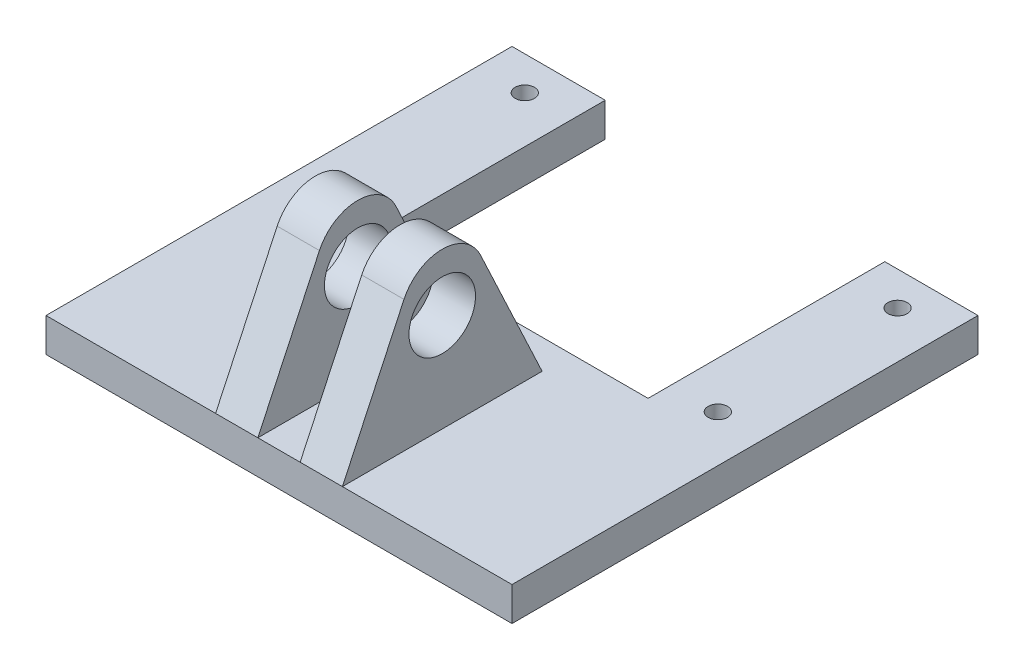
ISO-10303-21;
HEADER;
FILE_DESCRIPTION(('STEP AP214'),'2;1');
FILE_NAME('part.step','',(''),(''),'','','');
FILE_SCHEMA(('AUTOMOTIVE_DESIGN { 1 0 10303 214 1 1 1 1 }'));
ENDSEC;
DATA;
#1=APPLICATION_CONTEXT('core data for automotive mechanical design processes');
#2=APPLICATION_PROTOCOL_DEFINITION('international standard','automotive_design',2000,#1);
#3=PRODUCT_CONTEXT('',#1,'mechanical');
#4=PRODUCT('Part','Part','',(#3));
#5=PRODUCT_RELATED_PRODUCT_CATEGORY('part','',(#4));
#6=PRODUCT_DEFINITION_FORMATION('','',#4);
#7=PRODUCT_DEFINITION_CONTEXT('part definition',#1,'design');
#8=PRODUCT_DEFINITION('design','',#6,#7);
#9=PRODUCT_DEFINITION_SHAPE('','',#8);
#10=(LENGTH_UNIT() NAMED_UNIT(*) SI_UNIT(.MILLI.,.METRE.));
#11=(NAMED_UNIT(*) PLANE_ANGLE_UNIT() SI_UNIT($,.RADIAN.));
#12=(NAMED_UNIT(*) SI_UNIT($,.STERADIAN.) SOLID_ANGLE_UNIT());
#13=UNCERTAINTY_MEASURE_WITH_UNIT(LENGTH_MEASURE(1.E-05),#10,'distance_accuracy_value','');
#14=(GEOMETRIC_REPRESENTATION_CONTEXT(3) GLOBAL_UNCERTAINTY_ASSIGNED_CONTEXT((#13)) GLOBAL_UNIT_ASSIGNED_CONTEXT((#10,
#11,#12)) REPRESENTATION_CONTEXT('',''));
#15=CARTESIAN_POINT('',(0.,0.,0.));
#16=DIRECTION('',(0.,0.,1.));
#17=DIRECTION('',(1.,0.,0.));
#18=AXIS2_PLACEMENT_3D('',#15,#16,#17);
#19=CARTESIAN_POINT('',(4.7625,18.54,-7.5));
#20=DIRECTION('',(0.,-0.42443387623072,-0.905458935958868));
#21=DIRECTION('',(0.,0.905458935958868,-0.42443387623072));
#22=AXIS2_PLACEMENT_3D('',#19,#20,#21);
#23=PLANE('',#22);
#24=DIRECTION('',(0.,-0.905458935958868,0.42443387623072));
#25=VECTOR('',#24,1.);
#26=CARTESIAN_POINT('',(-1.5875,18.54,-7.5));
#27=LINE('',#26,#25);
#28=CARTESIAN_POINT('',(-1.5875,12.4070248071053,-4.62516787833059));
#29=VERTEX_POINT('',#28);
#30=CARTESIAN_POINT('',(-1.5875,2.54,0.));
#31=VERTEX_POINT('',#30);
#32=EDGE_CURVE('E158',#29,#31,#27,.T.);
#33=ORIENTED_EDGE('',*,*,#32,.F.);
#34=DIRECTION('',(-1.,0.,0.));
#35=VECTOR('',#34,1.);
#36=CARTESIAN_POINT('',(4.7625,12.4070248071053,-4.62516787833059));
#37=LINE('',#36,#35);
#38=CARTESIAN_POINT('',(-4.7625,12.4070248071053,-4.62516787833059));
#39=VERTEX_POINT('',#38);
#40=EDGE_CURVE('E311',#29,#39,#37,.T.);
#41=ORIENTED_EDGE('',*,*,#40,.T.);
#42=DIRECTION('',(0.,-0.905458935958868,0.42443387623072));
#43=VECTOR('',#42,1.);
#44=CARTESIAN_POINT('',(-4.7625,18.54,-7.5));
#45=LINE('',#44,#43);
#46=CARTESIAN_POINT('',(-4.7625,2.54,0.));
#47=VERTEX_POINT('',#46);
#48=EDGE_CURVE('E167',#39,#47,#45,.T.);
#49=ORIENTED_EDGE('',*,*,#48,.T.);
#50=DIRECTION('',(-1.,0.,0.));
#51=VECTOR('',#50,1.);
#52=CARTESIAN_POINT('',(4.7625,2.54,0.));
#53=LINE('',#52,#51);
#54=EDGE_CURVE('E182',#31,#47,#53,.T.);
#55=ORIENTED_EDGE('',*,*,#54,.F.);
#56=EDGE_LOOP('',(#33,#41,#49,#55));
#57=FACE_BOUND('',#56,.T.);
#58=ADVANCED_FACE('F45',(#57),#23,.F.);
#59=DIRECTION('',(0.,-0.905458935958868,0.42443387623072));
#60=VECTOR('',#59,1.);
#61=CARTESIAN_POINT('',(4.7625,18.54,-7.5));
#62=LINE('',#61,#60);
#63=CARTESIAN_POINT('',(4.7625,12.4070248071053,-4.62516787833059));
#64=VERTEX_POINT('',#63);
#65=CARTESIAN_POINT('',(4.7625,2.54,0.));
#66=VERTEX_POINT('',#65);
#67=EDGE_CURVE('E205',#64,#66,#62,.T.);
#68=ORIENTED_EDGE('',*,*,#67,.F.);
#69=DIRECTION('',(-1.,0.,0.));
#70=VECTOR('',#69,1.);
#71=CARTESIAN_POINT('',(4.7625,12.4070248071053,-4.62516787833059));
#72=LINE('',#71,#70);
#73=CARTESIAN_POINT('',(1.5875,12.4070248071053,-4.62516787833059));
#74=VERTEX_POINT('',#73);
#75=EDGE_CURVE('E302',#64,#74,#72,.T.);
#76=ORIENTED_EDGE('',*,*,#75,.T.);
#77=DIRECTION('',(0.,0.905458935958868,-0.42443387623072));
#78=VECTOR('',#77,1.);
#79=CARTESIAN_POINT('',(1.5875,18.54,-7.5));
#80=LINE('',#79,#78);
#81=CARTESIAN_POINT('',(1.5875,2.54,0.));
#82=VERTEX_POINT('',#81);
#83=EDGE_CURVE('E201',#82,#74,#80,.T.);
#84=ORIENTED_EDGE('',*,*,#83,.F.);
#85=EDGE_CURVE('E186',#66,#82,#53,.T.);
#86=ORIENTED_EDGE('',*,*,#85,.F.);
#87=EDGE_LOOP('',(#68,#76,#84,#86));
#88=FACE_BOUND('',#87,.T.);
#89=ADVANCED_FACE('F341',(#88),#23,.F.);
#90=CARTESIAN_POINT('',(4.7625,2.54,-15.));
#91=DIRECTION('',(0.,-0.424433876230719,0.905458935958868));
#92=DIRECTION('',(0.,-0.905458935958869,-0.42443387623072));
#93=AXIS2_PLACEMENT_3D('',#90,#91,#92);
#94=PLANE('',#93);
#95=DIRECTION('',(0.,0.905458935958869,0.42443387623072));
#96=VECTOR('',#95,1.);
#97=CARTESIAN_POINT('',(-4.7625,2.54,-15.));
#98=LINE('',#97,#96);
#99=CARTESIAN_POINT('',(-4.7625,2.54,-15.));
#100=VERTEX_POINT('',#99);
#101=CARTESIAN_POINT('',(-4.7625,12.4070248071053,-10.3748321216694));
#102=VERTEX_POINT('',#101);
#103=EDGE_CURVE('E208',#100,#102,#98,.T.);
#104=ORIENTED_EDGE('',*,*,#103,.T.);
#105=DIRECTION('',(-1.,0.,0.));
#106=VECTOR('',#105,1.);
#107=CARTESIAN_POINT('',(4.7625,12.4070248071053,-10.3748321216694));
#108=LINE('',#107,#106);
#109=CARTESIAN_POINT('',(-1.5875,12.4070248071053,-10.3748321216694));
#110=VERTEX_POINT('',#109);
#111=EDGE_CURVE('E54',#102,#110,#108,.F.);
#112=ORIENTED_EDGE('',*,*,#111,.T.);
#113=DIRECTION('',(0.,0.905458935958869,0.42443387623072));
#114=VECTOR('',#113,1.);
#115=CARTESIAN_POINT('',(-1.5875,2.54,-15.));
#116=LINE('',#115,#114);
#117=CARTESIAN_POINT('',(-1.5875,2.54,-15.));
#118=VERTEX_POINT('',#117);
#119=EDGE_CURVE('E168',#118,#110,#116,.T.);
#120=ORIENTED_EDGE('',*,*,#119,.F.);
#121=DIRECTION('',(-1.,0.,0.));
#122=VECTOR('',#121,1.);
#123=CARTESIAN_POINT('',(4.7625,2.54,-15.));
#124=LINE('',#123,#122);
#125=EDGE_CURVE('E178',#118,#100,#124,.T.);
#126=ORIENTED_EDGE('',*,*,#125,.T.);
#127=EDGE_LOOP('',(#104,#112,#120,#126));
#128=FACE_BOUND('',#127,.T.);
#129=ADVANCED_FACE('F364',(#128),#94,.F.);
#130=DIRECTION('',(0.,-0.905458935958869,-0.42443387623072));
#131=VECTOR('',#130,1.);
#132=CARTESIAN_POINT('',(1.5875,2.54,-15.));
#133=LINE('',#132,#131);
#134=CARTESIAN_POINT('',(1.5875,12.4070248071053,-10.3748321216694));
#135=VERTEX_POINT('',#134);
#136=CARTESIAN_POINT('',(1.5875,2.54,-15.));
#137=VERTEX_POINT('',#136);
#138=EDGE_CURVE('E196',#135,#137,#133,.T.);
#139=ORIENTED_EDGE('',*,*,#138,.F.);
#140=DIRECTION('',(-1.,0.,0.));
#141=VECTOR('',#140,1.);
#142=CARTESIAN_POINT('',(4.7625,12.4070248071053,-10.3748321216694));
#143=LINE('',#142,#141);
#144=CARTESIAN_POINT('',(4.7625,12.4070248071053,-10.3748321216694));
#145=VERTEX_POINT('',#144);
#146=EDGE_CURVE('E307',#135,#145,#143,.F.);
#147=ORIENTED_EDGE('',*,*,#146,.T.);
#148=DIRECTION('',(0.,0.905458935958869,0.42443387623072));
#149=VECTOR('',#148,1.);
#150=CARTESIAN_POINT('',(4.7625,2.54,-15.));
#151=LINE('',#150,#149);
#152=CARTESIAN_POINT('',(4.7625,2.54,-15.));
#153=VERTEX_POINT('',#152);
#154=EDGE_CURVE('E211',#153,#145,#151,.T.);
#155=ORIENTED_EDGE('',*,*,#154,.F.);
#156=EDGE_CURVE('E187',#153,#137,#124,.T.);
#157=ORIENTED_EDGE('',*,*,#156,.T.);
#158=EDGE_LOOP('',(#139,#147,#155,#157));
#159=FACE_BOUND('',#158,.T.);
#160=ADVANCED_FACE('F346',(#159),#94,.F.);
#161=CARTESIAN_POINT('',(0.,2.54,0.));
#162=DIRECTION('',(0.,-1.,0.));
#163=DIRECTION('',(0.,0.,-1.));
#164=AXIS2_PLACEMENT_3D('',#161,#162,#163);
#165=PLANE('',#164);
#166=CARTESIAN_POINT('',(14.,2.54,-18.96));
#167=DIRECTION('',(0.,1.,0.));
#168=DIRECTION('',(0.,0.,1.));
#169=AXIS2_PLACEMENT_3D('',#166,#167,#168);
#170=CIRCLE('',#169,0.725);
#171=CARTESIAN_POINT('',(14.,2.54,-18.235));
#172=VERTEX_POINT('',#171);
#173=EDGE_CURVE('E221',#172,#172,#170,.T.);
#174=ORIENTED_EDGE('',*,*,#173,.F.);
#175=EDGE_LOOP('',(#174));
#176=FACE_BOUND('',#175,.T.);
#177=CARTESIAN_POINT('',(14.,2.54,-32.46));
#178=DIRECTION('',(0.,1.,0.));
#179=DIRECTION('',(0.,0.,1.));
#180=AXIS2_PLACEMENT_3D('',#177,#178,#179);
#181=CIRCLE('',#180,0.725000000000001);
#182=CARTESIAN_POINT('',(14.,2.54,-31.735));
#183=VERTEX_POINT('',#182);
#184=EDGE_CURVE('E227',#183,#183,#181,.T.);
#185=ORIENTED_EDGE('',*,*,#184,.F.);
#186=EDGE_LOOP('',(#185));
#187=FACE_BOUND('',#186,.T.);
#188=CARTESIAN_POINT('',(-14.,2.54,-18.96));
#189=DIRECTION('',(0.,1.,0.));
#190=DIRECTION('',(0.,0.,1.));
#191=AXIS2_PLACEMENT_3D('',#188,#189,#190);
#192=CIRCLE('',#191,0.725);
#193=CARTESIAN_POINT('',(-14.,2.54,-18.235));
#194=VERTEX_POINT('',#193);
#195=EDGE_CURVE('E233',#194,#194,#192,.T.);
#196=ORIENTED_EDGE('',*,*,#195,.F.);
#197=EDGE_LOOP('',(#196));
#198=FACE_BOUND('',#197,.T.);
#199=CARTESIAN_POINT('',(-14.,2.54,-32.46));
#200=DIRECTION('',(0.,1.,0.));
#201=DIRECTION('',(0.,0.,1.));
#202=AXIS2_PLACEMENT_3D('',#199,#200,#201);
#203=CIRCLE('',#202,0.725000000000001);
#204=CARTESIAN_POINT('',(-14.,2.54,-31.735));
#205=VERTEX_POINT('',#204);
#206=EDGE_CURVE('E239',#205,#205,#203,.T.);
#207=ORIENTED_EDGE('',*,*,#206,.F.);
#208=EDGE_LOOP('',(#207));
#209=FACE_BOUND('',#208,.T.);
#210=DIRECTION('',(0.,0.,1.));
#211=VECTOR('',#210,1.);
#212=CARTESIAN_POINT('',(-4.7625,2.54,-15.));
#213=LINE('',#212,#211);
#214=EDGE_CURVE('E215',#100,#47,#213,.T.);
#215=ORIENTED_EDGE('',*,*,#214,.F.);
#216=ORIENTED_EDGE('',*,*,#125,.F.);
#217=DIRECTION('',(0.,0.,1.));
#218=VECTOR('',#217,1.);
#219=CARTESIAN_POINT('',(-1.5875,2.54,0.));
#220=LINE('',#219,#218);
#221=EDGE_CURVE('E161',#118,#31,#220,.T.);
#222=ORIENTED_EDGE('',*,*,#221,.T.);
#223=DIRECTION('',(1.,0.,0.));
#224=VECTOR('',#223,1.);
#225=CARTESIAN_POINT('',(-1.5875,2.54,0.));
#226=LINE('',#225,#224);
#227=EDGE_CURVE('E176',#31,#82,#226,.T.);
#228=ORIENTED_EDGE('',*,*,#227,.T.);
#229=DIRECTION('',(0.,0.,-1.));
#230=VECTOR('',#229,1.);
#231=CARTESIAN_POINT('',(1.5875,2.54,0.));
#232=LINE('',#231,#230);
#233=EDGE_CURVE('E194',#82,#137,#232,.T.);
#234=ORIENTED_EDGE('',*,*,#233,.T.);
#235=ORIENTED_EDGE('',*,*,#156,.F.);
#236=DIRECTION('',(0.,0.,1.));
#237=VECTOR('',#236,1.);
#238=CARTESIAN_POINT('',(4.7625,2.54,-15.));
#239=LINE('',#238,#237);
#240=EDGE_CURVE('E207',#153,#66,#239,.T.);
#241=ORIENTED_EDGE('',*,*,#240,.T.);
#242=DIRECTION('',(1.,0.,0.));
#243=VECTOR('',#242,1.);
#244=CARTESIAN_POINT('',(17.5,2.54,0.));
#245=LINE('',#244,#243);
#246=CARTESIAN_POINT('',(17.5,2.54,0.));
#247=VERTEX_POINT('',#246);
#248=EDGE_CURVE('E249',#66,#247,#245,.T.);
#249=ORIENTED_EDGE('',*,*,#248,.T.);
#250=DIRECTION('',(0.,0.,-1.));
#251=VECTOR('',#250,1.);
#252=CARTESIAN_POINT('',(17.5,2.54,-35.));
#253=LINE('',#252,#251);
#254=CARTESIAN_POINT('',(17.5,2.54,-35.));
#255=VERTEX_POINT('',#254);
#256=EDGE_CURVE('E248',#247,#255,#253,.T.);
#257=ORIENTED_EDGE('',*,*,#256,.T.);
#258=DIRECTION('',(-1.,0.,0.));
#259=VECTOR('',#258,1.);
#260=CARTESIAN_POINT('',(10.5,2.54,-35.));
#261=LINE('',#260,#259);
#262=CARTESIAN_POINT('',(10.5,2.54,-35.));
#263=VERTEX_POINT('',#262);
#264=EDGE_CURVE('E251',#255,#263,#261,.T.);
#265=ORIENTED_EDGE('',*,*,#264,.T.);
#266=DIRECTION('',(0.,0.,1.));
#267=VECTOR('',#266,1.);
#268=CARTESIAN_POINT('',(10.5,2.54,-17.22));
#269=LINE('',#268,#267);
#270=CARTESIAN_POINT('',(10.5,2.54,-17.22));
#271=VERTEX_POINT('',#270);
#272=EDGE_CURVE('E253',#263,#271,#269,.T.);
#273=ORIENTED_EDGE('',*,*,#272,.T.);
#274=DIRECTION('',(-1.,0.,0.));
#275=VECTOR('',#274,1.);
#276=CARTESIAN_POINT('',(-10.5,2.54,-17.22));
#277=LINE('',#276,#275);
#278=CARTESIAN_POINT('',(-10.5,2.54,-17.22));
#279=VERTEX_POINT('',#278);
#280=EDGE_CURVE('E255',#271,#279,#277,.T.);
#281=ORIENTED_EDGE('',*,*,#280,.T.);
#282=DIRECTION('',(0.,0.,-1.));
#283=VECTOR('',#282,1.);
#284=CARTESIAN_POINT('',(-10.5,2.54,-35.));
#285=LINE('',#284,#283);
#286=CARTESIAN_POINT('',(-10.5,2.54,-35.));
#287=VERTEX_POINT('',#286);
#288=EDGE_CURVE('E257',#279,#287,#285,.T.);
#289=ORIENTED_EDGE('',*,*,#288,.T.);
#290=DIRECTION('',(-1.,0.,0.));
#291=VECTOR('',#290,1.);
#292=CARTESIAN_POINT('',(-17.5,2.54,-35.));
#293=LINE('',#292,#291);
#294=CARTESIAN_POINT('',(-17.5,2.54,-35.));
#295=VERTEX_POINT('',#294);
#296=EDGE_CURVE('E259',#287,#295,#293,.T.);
#297=ORIENTED_EDGE('',*,*,#296,.T.);
#298=DIRECTION('',(0.,0.,1.));
#299=VECTOR('',#298,1.);
#300=CARTESIAN_POINT('',(-17.5,2.54,0.));
#301=LINE('',#300,#299);
#302=CARTESIAN_POINT('',(-17.5,2.54,0.));
#303=VERTEX_POINT('',#302);
#304=EDGE_CURVE('E261',#295,#303,#301,.T.);
#305=ORIENTED_EDGE('',*,*,#304,.T.);
#306=EDGE_CURVE('E245',#303,#47,#245,.T.);
#307=ORIENTED_EDGE('',*,*,#306,.T.);
#308=EDGE_LOOP('',(#215,#216,#222,#228,#234,#235,#241,#249,#257,#265,#273,#281,#289,#297,#305,#307));
#309=FACE_BOUND('',#308,.T.);
#310=ADVANCED_FACE('F173',(#176,#187,#198,#209,#309),#165,.F.);
#311=CARTESIAN_POINT('',(0.,0.,0.));
#312=DIRECTION('',(0.,-1.,0.));
#313=DIRECTION('',(0.,0.,-1.));
#314=AXIS2_PLACEMENT_3D('',#311,#312,#313);
#315=PLANE('',#314);
#316=CARTESIAN_POINT('',(14.,0.,-32.46));
#317=DIRECTION('',(0.,1.,0.));
#318=DIRECTION('',(0.,0.,1.));
#319=AXIS2_PLACEMENT_3D('',#316,#317,#318);
#320=CIRCLE('',#319,0.725000000000001);
#321=CARTESIAN_POINT('',(14.,0.,-31.735));
#322=VERTEX_POINT('',#321);
#323=EDGE_CURVE('E224',#322,#322,#320,.T.);
#324=ORIENTED_EDGE('',*,*,#323,.T.);
#325=EDGE_LOOP('',(#324));
#326=FACE_BOUND('',#325,.T.);
#327=CARTESIAN_POINT('',(-14.,0.,-32.46));
#328=DIRECTION('',(0.,1.,0.));
#329=DIRECTION('',(0.,0.,1.));
#330=AXIS2_PLACEMENT_3D('',#327,#328,#329);
#331=CIRCLE('',#330,0.725000000000001);
#332=CARTESIAN_POINT('',(-14.,0.,-31.735));
#333=VERTEX_POINT('',#332);
#334=EDGE_CURVE('E236',#333,#333,#331,.T.);
#335=ORIENTED_EDGE('',*,*,#334,.T.);
#336=EDGE_LOOP('',(#335));
#337=FACE_BOUND('',#336,.T.);
#338=DIRECTION('',(1.,0.,0.));
#339=VECTOR('',#338,1.);
#340=CARTESIAN_POINT('',(17.5,0.,0.));
#341=LINE('',#340,#339);
#342=CARTESIAN_POINT('',(-17.5,0.,0.));
#343=VERTEX_POINT('',#342);
#344=CARTESIAN_POINT('',(17.5,0.,0.));
#345=VERTEX_POINT('',#344);
#346=EDGE_CURVE('E242',#343,#345,#341,.T.);
#347=ORIENTED_EDGE('',*,*,#346,.F.);
#348=DIRECTION('',(0.,0.,1.));
#349=VECTOR('',#348,1.);
#350=CARTESIAN_POINT('',(-17.5,0.,0.));
#351=LINE('',#350,#349);
#352=CARTESIAN_POINT('',(-17.5,0.,-35.));
#353=VERTEX_POINT('',#352);
#354=EDGE_CURVE('E277',#353,#343,#351,.T.);
#355=ORIENTED_EDGE('',*,*,#354,.F.);
#356=DIRECTION('',(-1.,0.,0.));
#357=VECTOR('',#356,1.);
#358=CARTESIAN_POINT('',(-17.5,0.,-35.));
#359=LINE('',#358,#357);
#360=CARTESIAN_POINT('',(-10.5,0.,-35.));
#361=VERTEX_POINT('',#360);
#362=EDGE_CURVE('E275',#361,#353,#359,.T.);
#363=ORIENTED_EDGE('',*,*,#362,.F.);
#364=DIRECTION('',(0.,0.,-1.));
#365=VECTOR('',#364,1.);
#366=CARTESIAN_POINT('',(-10.5,0.,-35.));
#367=LINE('',#366,#365);
#368=CARTESIAN_POINT('',(-10.5,0.,-17.22));
#369=VERTEX_POINT('',#368);
#370=EDGE_CURVE('E273',#369,#361,#367,.T.);
#371=ORIENTED_EDGE('',*,*,#370,.F.);
#372=DIRECTION('',(-1.,0.,0.));
#373=VECTOR('',#372,1.);
#374=CARTESIAN_POINT('',(-10.5,0.,-17.22));
#375=LINE('',#374,#373);
#376=CARTESIAN_POINT('',(10.5,0.,-17.22));
#377=VERTEX_POINT('',#376);
#378=EDGE_CURVE('E271',#377,#369,#375,.T.);
#379=ORIENTED_EDGE('',*,*,#378,.F.);
#380=DIRECTION('',(0.,0.,1.));
#381=VECTOR('',#380,1.);
#382=CARTESIAN_POINT('',(10.5,0.,-17.22));
#383=LINE('',#382,#381);
#384=CARTESIAN_POINT('',(10.5,0.,-35.));
#385=VERTEX_POINT('',#384);
#386=EDGE_CURVE('E269',#385,#377,#383,.T.);
#387=ORIENTED_EDGE('',*,*,#386,.F.);
#388=DIRECTION('',(-1.,0.,0.));
#389=VECTOR('',#388,1.);
#390=CARTESIAN_POINT('',(10.5,0.,-35.));
#391=LINE('',#390,#389);
#392=CARTESIAN_POINT('',(17.5,0.,-35.));
#393=VERTEX_POINT('',#392);
#394=EDGE_CURVE('E267',#393,#385,#391,.T.);
#395=ORIENTED_EDGE('',*,*,#394,.F.);
#396=DIRECTION('',(0.,0.,-1.));
#397=VECTOR('',#396,1.);
#398=CARTESIAN_POINT('',(17.5,0.,-35.));
#399=LINE('',#398,#397);
#400=EDGE_CURVE('E265',#345,#393,#399,.T.);
#401=ORIENTED_EDGE('',*,*,#400,.F.);
#402=EDGE_LOOP('',(#347,#355,#363,#371,#379,#387,#395,#401));
#403=FACE_BOUND('',#402,.T.);
#404=CARTESIAN_POINT('',(-14.,0.,-18.96));
#405=DIRECTION('',(0.,1.,0.));
#406=DIRECTION('',(0.,0.,1.));
#407=AXIS2_PLACEMENT_3D('',#404,#405,#406);
#408=CIRCLE('',#407,0.725);
#409=CARTESIAN_POINT('',(-14.,0.,-18.235));
#410=VERTEX_POINT('',#409);
#411=EDGE_CURVE('E230',#410,#410,#408,.T.);
#412=ORIENTED_EDGE('',*,*,#411,.T.);
#413=EDGE_LOOP('',(#412));
#414=FACE_BOUND('',#413,.T.);
#415=CARTESIAN_POINT('',(14.,0.,-18.96));
#416=DIRECTION('',(0.,1.,0.));
#417=DIRECTION('',(0.,0.,1.));
#418=AXIS2_PLACEMENT_3D('',#415,#416,#417);
#419=CIRCLE('',#418,0.725);
#420=CARTESIAN_POINT('',(14.,0.,-18.235));
#421=VERTEX_POINT('',#420);
#422=EDGE_CURVE('E220',#421,#421,#419,.T.);
#423=ORIENTED_EDGE('',*,*,#422,.T.);
#424=EDGE_LOOP('',(#423));
#425=FACE_BOUND('',#424,.T.);
#426=ADVANCED_FACE('F323',(#326,#337,#403,#414,#425),#315,.T.);
#427=CARTESIAN_POINT('',(17.5,2.54,0.));
#428=DIRECTION('',(0.,0.,-1.));
#429=DIRECTION('',(-1.,0.,0.));
#430=AXIS2_PLACEMENT_3D('',#427,#428,#429);
#431=PLANE('',#430);
#432=ORIENTED_EDGE('',*,*,#346,.T.);
#433=DIRECTION('',(0.,-1.,0.));
#434=VECTOR('',#433,1.);
#435=CARTESIAN_POINT('',(17.5,2.54,0.));
#436=LINE('',#435,#434);
#437=EDGE_CURVE('E299',#247,#345,#436,.T.);
#438=ORIENTED_EDGE('',*,*,#437,.F.);
#439=ORIENTED_EDGE('',*,*,#248,.F.);
#440=ORIENTED_EDGE('',*,*,#85,.T.);
#441=ORIENTED_EDGE('',*,*,#227,.F.);
#442=ORIENTED_EDGE('',*,*,#54,.T.);
#443=ORIENTED_EDGE('',*,*,#306,.F.);
#444=DIRECTION('',(0.,-1.,0.));
#445=VECTOR('',#444,1.);
#446=CARTESIAN_POINT('',(-17.5,2.54,0.));
#447=LINE('',#446,#445);
#448=EDGE_CURVE('E263',#303,#343,#447,.T.);
#449=ORIENTED_EDGE('',*,*,#448,.T.);
#450=EDGE_LOOP('',(#432,#438,#439,#440,#441,#442,#443,#449));
#451=FACE_BOUND('',#450,.T.);
#452=ADVANCED_FACE('F191',(#451),#431,.F.);
#453=CARTESIAN_POINT('',(17.5,2.54,-35.));
#454=DIRECTION('',(-1.,0.,0.));
#455=DIRECTION('',(0.,0.,1.));
#456=AXIS2_PLACEMENT_3D('',#453,#454,#455);
#457=PLANE('',#456);
#458=ORIENTED_EDGE('',*,*,#400,.T.);
#459=DIRECTION('',(0.,-1.,0.));
#460=VECTOR('',#459,1.);
#461=CARTESIAN_POINT('',(17.5,2.54,-35.));
#462=LINE('',#461,#460);
#463=EDGE_CURVE('E296',#255,#393,#462,.T.);
#464=ORIENTED_EDGE('',*,*,#463,.F.);
#465=ORIENTED_EDGE('',*,*,#256,.F.);
#466=ORIENTED_EDGE('',*,*,#437,.T.);
#467=EDGE_LOOP('',(#458,#464,#465,#466));
#468=FACE_BOUND('',#467,.T.);
#469=ADVANCED_FACE('F331',(#468),#457,.F.);
#470=CARTESIAN_POINT('',(10.5,2.54,-35.));
#471=DIRECTION('',(0.,0.,1.));
#472=DIRECTION('',(1.,0.,0.));
#473=AXIS2_PLACEMENT_3D('',#470,#471,#472);
#474=PLANE('',#473);
#475=ORIENTED_EDGE('',*,*,#394,.T.);
#476=DIRECTION('',(0.,-1.,0.));
#477=VECTOR('',#476,1.);
#478=CARTESIAN_POINT('',(10.5,2.54,-35.));
#479=LINE('',#478,#477);
#480=EDGE_CURVE('E293',#263,#385,#479,.T.);
#481=ORIENTED_EDGE('',*,*,#480,.F.);
#482=ORIENTED_EDGE('',*,*,#264,.F.);
#483=ORIENTED_EDGE('',*,*,#463,.T.);
#484=EDGE_LOOP('',(#475,#481,#482,#483));
#485=FACE_BOUND('',#484,.T.);
#486=ADVANCED_FACE('F408',(#485),#474,.F.);
#487=CARTESIAN_POINT('',(10.5,2.54,-17.22));
#488=DIRECTION('',(1.,0.,0.));
#489=DIRECTION('',(0.,0.,-1.));
#490=AXIS2_PLACEMENT_3D('',#487,#488,#489);
#491=PLANE('',#490);
#492=ORIENTED_EDGE('',*,*,#386,.T.);
#493=DIRECTION('',(0.,-1.,0.));
#494=VECTOR('',#493,1.);
#495=CARTESIAN_POINT('',(10.5,2.54,-17.22));
#496=LINE('',#495,#494);
#497=EDGE_CURVE('E290',#271,#377,#496,.T.);
#498=ORIENTED_EDGE('',*,*,#497,.F.);
#499=ORIENTED_EDGE('',*,*,#272,.F.);
#500=ORIENTED_EDGE('',*,*,#480,.T.);
#501=EDGE_LOOP('',(#492,#498,#499,#500));
#502=FACE_BOUND('',#501,.T.);
#503=ADVANCED_FACE('F404',(#502),#491,.F.);
#504=CARTESIAN_POINT('',(-10.5,2.54,-17.22));
#505=DIRECTION('',(0.,0.,1.));
#506=DIRECTION('',(1.,0.,0.));
#507=AXIS2_PLACEMENT_3D('',#504,#505,#506);
#508=PLANE('',#507);
#509=ORIENTED_EDGE('',*,*,#378,.T.);
#510=DIRECTION('',(0.,-1.,0.));
#511=VECTOR('',#510,1.);
#512=CARTESIAN_POINT('',(-10.5,2.54,-17.22));
#513=LINE('',#512,#511);
#514=EDGE_CURVE('E287',#279,#369,#513,.T.);
#515=ORIENTED_EDGE('',*,*,#514,.F.);
#516=ORIENTED_EDGE('',*,*,#280,.F.);
#517=ORIENTED_EDGE('',*,*,#497,.T.);
#518=EDGE_LOOP('',(#509,#515,#516,#517));
#519=FACE_BOUND('',#518,.T.);
#520=ADVANCED_FACE('F400',(#519),#508,.F.);
#521=CARTESIAN_POINT('',(-10.5,2.54,-35.));
#522=DIRECTION('',(-1.,0.,0.));
#523=DIRECTION('',(0.,0.,1.));
#524=AXIS2_PLACEMENT_3D('',#521,#522,#523);
#525=PLANE('',#524);
#526=ORIENTED_EDGE('',*,*,#370,.T.);
#527=DIRECTION('',(0.,-1.,0.));
#528=VECTOR('',#527,1.);
#529=CARTESIAN_POINT('',(-10.5,2.54,-35.));
#530=LINE('',#529,#528);
#531=EDGE_CURVE('E284',#287,#361,#530,.T.);
#532=ORIENTED_EDGE('',*,*,#531,.F.);
#533=ORIENTED_EDGE('',*,*,#288,.F.);
#534=ORIENTED_EDGE('',*,*,#514,.T.);
#535=EDGE_LOOP('',(#526,#532,#533,#534));
#536=FACE_BOUND('',#535,.T.);
#537=ADVANCED_FACE('F396',(#536),#525,.F.);
#538=CARTESIAN_POINT('',(-17.5,2.54,-35.));
#539=DIRECTION('',(0.,0.,1.));
#540=DIRECTION('',(1.,0.,0.));
#541=AXIS2_PLACEMENT_3D('',#538,#539,#540);
#542=PLANE('',#541);
#543=ORIENTED_EDGE('',*,*,#362,.T.);
#544=DIRECTION('',(0.,-1.,0.));
#545=VECTOR('',#544,1.);
#546=CARTESIAN_POINT('',(-17.5,2.54,-35.));
#547=LINE('',#546,#545);
#548=EDGE_CURVE('E281',#295,#353,#547,.T.);
#549=ORIENTED_EDGE('',*,*,#548,.F.);
#550=ORIENTED_EDGE('',*,*,#296,.F.);
#551=ORIENTED_EDGE('',*,*,#531,.T.);
#552=EDGE_LOOP('',(#543,#549,#550,#551));
#553=FACE_BOUND('',#552,.T.);
#554=ADVANCED_FACE('F393',(#553),#542,.F.);
#555=CARTESIAN_POINT('',(-17.5,2.54,0.));
#556=DIRECTION('',(1.,0.,0.));
#557=DIRECTION('',(0.,0.,-1.));
#558=AXIS2_PLACEMENT_3D('',#555,#556,#557);
#559=PLANE('',#558);
#560=ORIENTED_EDGE('',*,*,#354,.T.);
#561=ORIENTED_EDGE('',*,*,#448,.F.);
#562=ORIENTED_EDGE('',*,*,#304,.F.);
#563=ORIENTED_EDGE('',*,*,#548,.T.);
#564=EDGE_LOOP('',(#560,#561,#562,#563));
#565=FACE_BOUND('',#564,.T.);
#566=ADVANCED_FACE('F383',(#565),#559,.F.);
#567=CARTESIAN_POINT('',(-14.,2.54,-32.46));
#568=DIRECTION('',(0.,-1.,0.));
#569=DIRECTION('',(0.,0.,-1.));
#570=AXIS2_PLACEMENT_3D('',#567,#568,#569);
#571=CYLINDRICAL_SURFACE('',#570,0.725000000000001);
#572=ORIENTED_EDGE('',*,*,#206,.T.);
#573=EDGE_LOOP('',(#572));
#574=FACE_BOUND('',#573,.T.);
#575=ORIENTED_EDGE('',*,*,#334,.F.);
#576=EDGE_LOOP('',(#575));
#577=FACE_BOUND('',#576,.T.);
#578=ADVANCED_FACE('F379',(#574,#577),#571,.F.);
#579=CARTESIAN_POINT('',(-14.,2.54,-18.96));
#580=DIRECTION('',(0.,-1.,0.));
#581=DIRECTION('',(0.,0.,-1.));
#582=AXIS2_PLACEMENT_3D('',#579,#580,#581);
#583=CYLINDRICAL_SURFACE('',#582,0.725);
#584=ORIENTED_EDGE('',*,*,#195,.T.);
#585=EDGE_LOOP('',(#584));
#586=FACE_BOUND('',#585,.T.);
#587=ORIENTED_EDGE('',*,*,#411,.F.);
#588=EDGE_LOOP('',(#587));
#589=FACE_BOUND('',#588,.T.);
#590=ADVANCED_FACE('F375',(#586,#589),#583,.F.);
#591=CARTESIAN_POINT('',(14.,2.54,-32.46));
#592=DIRECTION('',(0.,-1.,0.));
#593=DIRECTION('',(0.,0.,-1.));
#594=AXIS2_PLACEMENT_3D('',#591,#592,#593);
#595=CYLINDRICAL_SURFACE('',#594,0.725000000000001);
#596=ORIENTED_EDGE('',*,*,#184,.T.);
#597=EDGE_LOOP('',(#596));
#598=FACE_BOUND('',#597,.T.);
#599=ORIENTED_EDGE('',*,*,#323,.F.);
#600=EDGE_LOOP('',(#599));
#601=FACE_BOUND('',#600,.T.);
#602=ADVANCED_FACE('F371',(#598,#601),#595,.F.);
#603=CARTESIAN_POINT('',(14.,2.54,-18.96));
#604=DIRECTION('',(0.,-1.,0.));
#605=DIRECTION('',(0.,0.,-1.));
#606=AXIS2_PLACEMENT_3D('',#603,#604,#605);
#607=CYLINDRICAL_SURFACE('',#606,0.725);
#608=ORIENTED_EDGE('',*,*,#173,.T.);
#609=EDGE_LOOP('',(#608));
#610=FACE_BOUND('',#609,.T.);
#611=ORIENTED_EDGE('',*,*,#422,.F.);
#612=EDGE_LOOP('',(#611));
#613=FACE_BOUND('',#612,.T.);
#614=ADVANCED_FACE('F368',(#610,#613),#607,.F.);
#615=CARTESIAN_POINT('',(4.7625,0.,0.));
#616=DIRECTION('',(-1.,0.,0.));
#617=DIRECTION('',(0.,0.,1.));
#618=AXIS2_PLACEMENT_3D('',#615,#616,#617);
#619=PLANE('',#618);
#620=CARTESIAN_POINT('',(4.7625,9.94,-7.5));
#621=DIRECTION('',(-1.,0.,0.));
#622=DIRECTION('',(0.,0.,1.));
#623=AXIS2_PLACEMENT_3D('',#620,#621,#622);
#624=CIRCLE('',#623,2.49999999999999);
#625=CARTESIAN_POINT('',(4.7625,9.94,-5.00000000000001));
#626=VERTEX_POINT('',#625);
#627=EDGE_CURVE('E179',#626,#626,#624,.T.);
#628=ORIENTED_EDGE('',*,*,#627,.T.);
#629=EDGE_LOOP('',(#628));
#630=FACE_BOUND('',#629,.T.);
#631=ORIENTED_EDGE('',*,*,#154,.T.);
#632=CARTESIAN_POINT('',(4.7625,11.0594472500727,-7.5));
#633=DIRECTION('',(-1.,0.,0.));
#634=DIRECTION('',(0.,0.,1.));
#635=AXIS2_PLACEMENT_3D('',#632,#633,#634);
#636=CIRCLE('',#635,3.175);
#637=EDGE_CURVE('E309',#145,#64,#636,.F.);
#638=ORIENTED_EDGE('',*,*,#637,.T.);
#639=ORIENTED_EDGE('',*,*,#67,.T.);
#640=ORIENTED_EDGE('',*,*,#240,.F.);
#641=EDGE_LOOP('',(#631,#638,#639,#640));
#642=FACE_BOUND('',#641,.T.);
#643=ADVANCED_FACE('F335',(#630,#642),#619,.F.);
#644=CARTESIAN_POINT('',(-4.7625,0.,0.));
#645=DIRECTION('',(-1.,0.,0.));
#646=DIRECTION('',(0.,0.,1.));
#647=AXIS2_PLACEMENT_3D('',#644,#645,#646);
#648=PLANE('',#647);
#649=CARTESIAN_POINT('',(-4.7625,9.94,-7.5));
#650=DIRECTION('',(-1.,0.,0.));
#651=DIRECTION('',(0.,0.,1.));
#652=AXIS2_PLACEMENT_3D('',#649,#650,#651);
#653=CIRCLE('',#652,2.49999999999999);
#654=CARTESIAN_POINT('',(-4.7625,9.94,-5.00000000000001));
#655=VERTEX_POINT('',#654);
#656=EDGE_CURVE('E521',#655,#655,#653,.T.);
#657=ORIENTED_EDGE('',*,*,#656,.F.);
#658=EDGE_LOOP('',(#657));
#659=FACE_BOUND('',#658,.T.);
#660=ORIENTED_EDGE('',*,*,#48,.F.);
#661=CARTESIAN_POINT('',(-4.7625,11.0594472500727,-7.5));
#662=DIRECTION('',(-1.,0.,0.));
#663=DIRECTION('',(0.,0.,1.));
#664=AXIS2_PLACEMENT_3D('',#661,#662,#663);
#665=CIRCLE('',#664,3.175);
#666=EDGE_CURVE('E68',#39,#102,#665,.T.);
#667=ORIENTED_EDGE('',*,*,#666,.T.);
#668=ORIENTED_EDGE('',*,*,#103,.F.);
#669=ORIENTED_EDGE('',*,*,#214,.T.);
#670=EDGE_LOOP('',(#660,#667,#668,#669));
#671=FACE_BOUND('',#670,.T.);
#672=ADVANCED_FACE('F315',(#659,#671),#648,.T.);
#673=CARTESIAN_POINT('',(-1.5875,18.54,0.));
#674=DIRECTION('',(1.,0.,0.));
#675=DIRECTION('',(0.,0.,-1.));
#676=AXIS2_PLACEMENT_3D('',#673,#674,#675);
#677=PLANE('',#676);
#678=CARTESIAN_POINT('',(-1.5875,9.94,-7.5));
#679=DIRECTION('',(1.,0.,0.));
#680=DIRECTION('',(0.,0.,-1.));
#681=AXIS2_PLACEMENT_3D('',#678,#679,#680);
#682=CIRCLE('',#681,2.49999999999999);
#683=CARTESIAN_POINT('',(-1.5875,9.94,-9.99999999999999));
#684=VERTEX_POINT('',#683);
#685=EDGE_CURVE('E49',#684,#684,#682,.T.);
#686=ORIENTED_EDGE('',*,*,#685,.F.);
#687=EDGE_LOOP('',(#686));
#688=FACE_BOUND('',#687,.T.);
#689=ORIENTED_EDGE('',*,*,#119,.T.);
#690=CARTESIAN_POINT('',(-1.5875,11.0594472500727,-7.5));
#691=DIRECTION('',(1.,0.,0.));
#692=DIRECTION('',(0.,0.,-1.));
#693=AXIS2_PLACEMENT_3D('',#690,#691,#692);
#694=CIRCLE('',#693,3.175);
#695=EDGE_CURVE('E12',#110,#29,#694,.T.);
#696=ORIENTED_EDGE('',*,*,#695,.T.);
#697=ORIENTED_EDGE('',*,*,#32,.T.);
#698=ORIENTED_EDGE('',*,*,#221,.F.);
#699=EDGE_LOOP('',(#689,#696,#697,#698));
#700=FACE_BOUND('',#699,.T.);
#701=ADVANCED_FACE('F160',(#688,#700),#677,.T.);
#702=CARTESIAN_POINT('',(1.5875,18.54,0.));
#703=DIRECTION('',(-1.,0.,0.));
#704=DIRECTION('',(0.,0.,1.));
#705=AXIS2_PLACEMENT_3D('',#702,#703,#704);
#706=PLANE('',#705);
#707=CARTESIAN_POINT('',(1.5875,9.94,-7.5));
#708=DIRECTION('',(-1.,0.,0.));
#709=DIRECTION('',(0.,0.,1.));
#710=AXIS2_PLACEMENT_3D('',#707,#708,#709);
#711=CIRCLE('',#710,2.49999999999999);
#712=CARTESIAN_POINT('',(1.5875,9.94,-5.00000000000001));
#713=VERTEX_POINT('',#712);
#714=EDGE_CURVE('E516',#713,#713,#711,.T.);
#715=ORIENTED_EDGE('',*,*,#714,.F.);
#716=EDGE_LOOP('',(#715));
#717=FACE_BOUND('',#716,.T.);
#718=ORIENTED_EDGE('',*,*,#83,.T.);
#719=CARTESIAN_POINT('',(1.5875,11.0594472500727,-7.5));
#720=DIRECTION('',(-1.,0.,0.));
#721=DIRECTION('',(0.,0.,1.));
#722=AXIS2_PLACEMENT_3D('',#719,#720,#721);
#723=CIRCLE('',#722,3.175);
#724=EDGE_CURVE('E305',#74,#135,#723,.T.);
#725=ORIENTED_EDGE('',*,*,#724,.T.);
#726=ORIENTED_EDGE('',*,*,#138,.T.);
#727=ORIENTED_EDGE('',*,*,#233,.F.);
#728=EDGE_LOOP('',(#718,#725,#726,#727));
#729=FACE_BOUND('',#728,.T.);
#730=ADVANCED_FACE('F343',(#717,#729),#706,.T.);
#731=CARTESIAN_POINT('',(4.7625,11.0594472500727,-7.5));
#732=DIRECTION('',(-1.,0.,0.));
#733=DIRECTION('',(0.,0.,1.));
#734=AXIS2_PLACEMENT_3D('',#731,#732,#733);
#735=CYLINDRICAL_SURFACE('',#734,3.175);
#736=ORIENTED_EDGE('',*,*,#637,.F.);
#737=ORIENTED_EDGE('',*,*,#146,.F.);
#738=ORIENTED_EDGE('',*,*,#724,.F.);
#739=ORIENTED_EDGE('',*,*,#75,.F.);
#740=EDGE_LOOP('',(#736,#737,#738,#739));
#741=FACE_BOUND('',#740,.T.);
#742=ADVANCED_FACE('F349',(#741),#735,.T.);
#743=CARTESIAN_POINT('',(4.7625,11.0594472500727,-7.5));
#744=DIRECTION('',(-1.,0.,0.));
#745=DIRECTION('',(0.,0.,1.));
#746=AXIS2_PLACEMENT_3D('',#743,#744,#745);
#747=CYLINDRICAL_SURFACE('',#746,3.175);
#748=ORIENTED_EDGE('',*,*,#695,.F.);
#749=ORIENTED_EDGE('',*,*,#111,.F.);
#750=ORIENTED_EDGE('',*,*,#666,.F.);
#751=ORIENTED_EDGE('',*,*,#40,.F.);
#752=EDGE_LOOP('',(#748,#749,#750,#751));
#753=FACE_BOUND('',#752,.T.);
#754=ADVANCED_FACE('F47',(#753),#747,.T.);
#755=CARTESIAN_POINT('',(-4.7625,9.94,-7.5));
#756=DIRECTION('',(-1.,0.,0.));
#757=DIRECTION('',(0.,0.,1.));
#758=AXIS2_PLACEMENT_3D('',#755,#756,#757);
#759=CYLINDRICAL_SURFACE('',#758,2.49999999999999);
#760=ORIENTED_EDGE('',*,*,#685,.T.);
#761=EDGE_LOOP('',(#760));
#762=FACE_BOUND('',#761,.T.);
#763=ORIENTED_EDGE('',*,*,#656,.T.);
#764=EDGE_LOOP('',(#763));
#765=FACE_BOUND('',#764,.T.);
#766=ADVANCED_FACE('F355',(#762,#765),#759,.F.);
#767=ORIENTED_EDGE('',*,*,#714,.T.);
#768=EDGE_LOOP('',(#767));
#769=FACE_BOUND('',#768,.T.);
#770=ORIENTED_EDGE('',*,*,#627,.F.);
#771=EDGE_LOOP('',(#770));
#772=FACE_BOUND('',#771,.T.);
#773=ADVANCED_FACE('F499',(#769,#772),#759,.F.);
#774=CLOSED_SHELL('',(#58,#89,#129,#160,#310,#426,#452,#469,#486,#503,#520,#537,#554,#566,#578,
#590,#602,#614,#643,#672,#701,#730,#742,#754,#766,#773));
#775=MANIFOLD_SOLID_BREP('B2',#774);
#776=ADVANCED_BREP_SHAPE_REPRESENTATION('',(#18,#775),#14);
#777=SHAPE_DEFINITION_REPRESENTATION(#9,#776);
ENDSEC;
END-ISO-10303-21;
